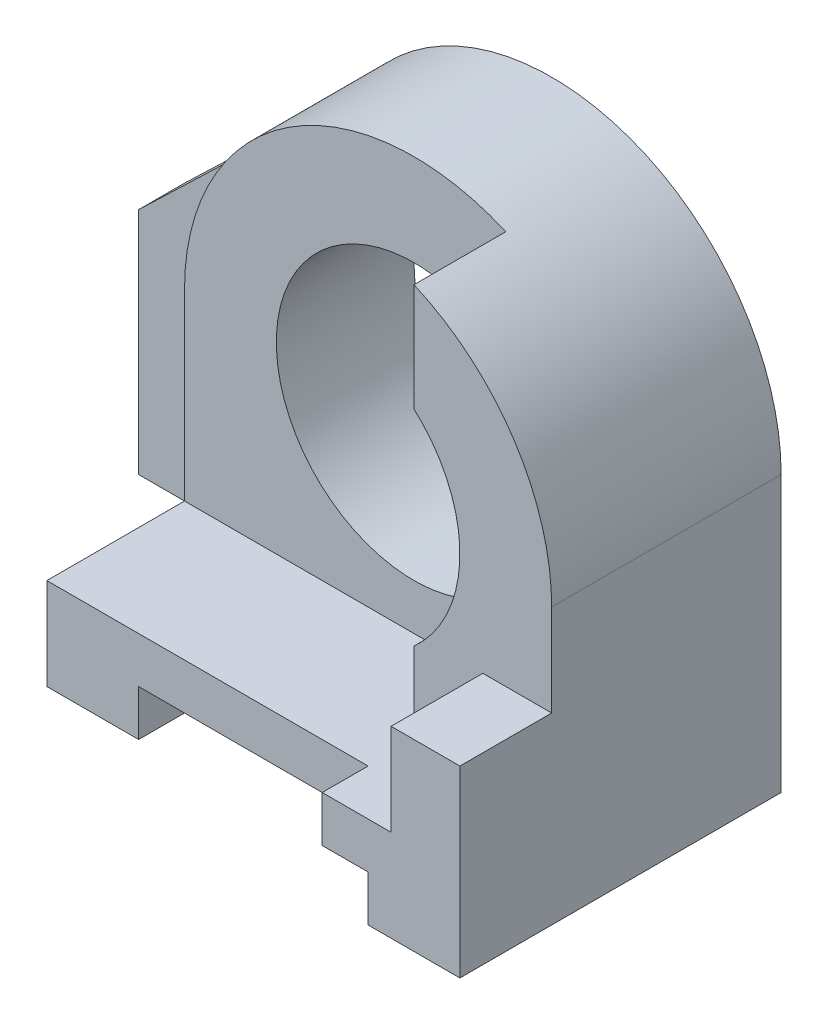
ISO-10303-21;
HEADER;
FILE_DESCRIPTION(('STEP AP214'),'2;1');
FILE_NAME('part.step','',(''),(''),'','','');
FILE_SCHEMA(('AUTOMOTIVE_DESIGN { 1 0 10303 214 1 1 1 1 }'));
ENDSEC;
DATA;
#1=APPLICATION_CONTEXT('core data for automotive mechanical design processes');
#2=APPLICATION_PROTOCOL_DEFINITION('international standard','automotive_design',2000,#1);
#3=PRODUCT_CONTEXT('',#1,'mechanical');
#4=PRODUCT('Part','Part','',(#3));
#5=PRODUCT_RELATED_PRODUCT_CATEGORY('part','',(#4));
#6=PRODUCT_DEFINITION_FORMATION('','',#4);
#7=PRODUCT_DEFINITION_CONTEXT('part definition',#1,'design');
#8=PRODUCT_DEFINITION('design','',#6,#7);
#9=PRODUCT_DEFINITION_SHAPE('','',#8);
#10=(LENGTH_UNIT() NAMED_UNIT(*) SI_UNIT(.MILLI.,.METRE.));
#11=(NAMED_UNIT(*) PLANE_ANGLE_UNIT() SI_UNIT($,.RADIAN.));
#12=(NAMED_UNIT(*) SI_UNIT($,.STERADIAN.) SOLID_ANGLE_UNIT());
#13=UNCERTAINTY_MEASURE_WITH_UNIT(LENGTH_MEASURE(1.E-05),#10,'distance_accuracy_value','');
#14=(GEOMETRIC_REPRESENTATION_CONTEXT(3) GLOBAL_UNCERTAINTY_ASSIGNED_CONTEXT((#13)) GLOBAL_UNIT_ASSIGNED_CONTEXT((#10,
#11,#12)) REPRESENTATION_CONTEXT('',''));
#15=CARTESIAN_POINT('',(0.,0.,0.));
#16=DIRECTION('',(0.,0.,1.));
#17=DIRECTION('',(1.,0.,0.));
#18=AXIS2_PLACEMENT_3D('',#15,#16,#17);
#19=CARTESIAN_POINT('',(0.,6.,7.));
#20=DIRECTION('',(1.,0.,0.));
#21=DIRECTION('',(0.,1.,0.));
#22=AXIS2_PLACEMENT_3D('',#19,#20,#21);
#23=PLANE('',#22);
#24=DIRECTION('',(0.,-1.,0.));
#25=VECTOR('',#24,1.);
#26=CARTESIAN_POINT('',(0.,14.,3.));
#27=LINE('',#26,#25);
#28=CARTESIAN_POINT('',(0.,6.,3.));
#29=VERTEX_POINT('',#28);
#30=CARTESIAN_POINT('',(0.,2.,3.));
#31=VERTEX_POINT('',#30);
#32=EDGE_CURVE('E186',#29,#31,#27,.T.);
#33=ORIENTED_EDGE('',*,*,#32,.F.);
#34=DIRECTION('',(0.,0.,-1.));
#35=VECTOR('',#34,1.);
#36=CARTESIAN_POINT('',(0.,6.,7.));
#37=LINE('',#36,#35);
#38=CARTESIAN_POINT('',(0.,6.,1.));
#39=VERTEX_POINT('',#38);
#40=EDGE_CURVE('E298',#29,#39,#37,.T.);
#41=ORIENTED_EDGE('',*,*,#40,.T.);
#42=DIRECTION('',(0.,-1.,0.));
#43=VECTOR('',#42,1.);
#44=CARTESIAN_POINT('',(0.,6.,1.));
#45=LINE('',#44,#43);
#46=CARTESIAN_POINT('',(0.,0.,1.));
#47=VERTEX_POINT('',#46);
#48=EDGE_CURVE('E278',#39,#47,#45,.T.);
#49=ORIENTED_EDGE('',*,*,#48,.T.);
#50=DIRECTION('',(0.,0.,-1.));
#51=VECTOR('',#50,1.);
#52=CARTESIAN_POINT('',(0.,0.,7.));
#53=LINE('',#52,#51);
#54=CARTESIAN_POINT('',(0.,0.,6.));
#55=VERTEX_POINT('',#54);
#56=EDGE_CURVE('E55',#55,#47,#53,.T.);
#57=ORIENTED_EDGE('',*,*,#56,.F.);
#58=DIRECTION('',(0.,-1.,0.));
#59=VECTOR('',#58,1.);
#60=CARTESIAN_POINT('',(0.,12.,6.));
#61=LINE('',#60,#59);
#62=CARTESIAN_POINT('',(0.,2.,6.));
#63=VERTEX_POINT('',#62);
#64=EDGE_CURVE('E213',#63,#55,#61,.T.);
#65=ORIENTED_EDGE('',*,*,#64,.F.);
#66=DIRECTION('',(0.,0.,1.));
#67=VECTOR('',#66,1.);
#68=CARTESIAN_POINT('',(0.,2.,3.));
#69=LINE('',#68,#67);
#70=EDGE_CURVE('E47',#31,#63,#69,.T.);
#71=ORIENTED_EDGE('',*,*,#70,.F.);
#72=EDGE_LOOP('',(#33,#41,#49,#57,#65,#71));
#73=FACE_BOUND('',#72,.T.);
#74=ADVANCED_FACE('F33',(#73),#23,.F.);
#75=CARTESIAN_POINT('',(5.,6.,7.));
#76=DIRECTION('',(0.,0.,-1.));
#77=DIRECTION('',(-1.,0.,0.));
#78=AXIS2_PLACEMENT_3D('',#75,#76,#77);
#79=CYLINDRICAL_SURFACE('',#78,5.);
#80=DIRECTION('',(0.,0.,-1.));
#81=VECTOR('',#80,1.);
#82=CARTESIAN_POINT('',(7.,10.5825756949558,7.));
#83=LINE('',#82,#81);
#84=CARTESIAN_POINT('',(7.,10.5825756949558,5.));
#85=VERTEX_POINT('',#84);
#86=CARTESIAN_POINT('',(7.,10.5825756949558,3.));
#87=VERTEX_POINT('',#86);
#88=EDGE_CURVE('E205',#85,#87,#83,.T.);
#89=ORIENTED_EDGE('',*,*,#88,.F.);
#90=CARTESIAN_POINT('',(5.,6.,5.));
#91=DIRECTION('',(0.,0.,1.));
#92=DIRECTION('',(1.,0.,0.));
#93=AXIS2_PLACEMENT_3D('',#90,#91,#92);
#94=CIRCLE('',#93,5.);
#95=CARTESIAN_POINT('',(10.,6.,5.));
#96=VERTEX_POINT('',#95);
#97=EDGE_CURVE('E251',#96,#85,#94,.T.);
#98=ORIENTED_EDGE('',*,*,#97,.F.);
#99=DIRECTION('',(0.,0.,-1.));
#100=VECTOR('',#99,1.);
#101=CARTESIAN_POINT('',(10.,6.,7.));
#102=LINE('',#101,#100);
#103=CARTESIAN_POINT('',(10.,6.,0.));
#104=VERTEX_POINT('',#103);
#105=EDGE_CURVE('E315',#96,#104,#102,.T.);
#106=ORIENTED_EDGE('',*,*,#105,.T.);
#107=CARTESIAN_POINT('',(5.,6.,0.));
#108=DIRECTION('',(0.,0.,1.));
#109=DIRECTION('',(1.,0.,0.));
#110=AXIS2_PLACEMENT_3D('',#107,#108,#109);
#111=CIRCLE('',#110,5.);
#112=CARTESIAN_POINT('',(0.705752772547543,8.56114051733146,0.));
#113=VERTEX_POINT('',#112);
#114=EDGE_CURVE('E291',#104,#113,#111,.T.);
#115=ORIENTED_EDGE('',*,*,#114,.T.);
#116=DIRECTION('',(0.,0.,-1.));
#117=VECTOR('',#116,1.);
#118=CARTESIAN_POINT('',(0.705752772547543,8.56114051733146,1.));
#119=LINE('',#118,#117);
#120=CARTESIAN_POINT('',(0.705752772547544,8.56114051733146,1.));
#121=VERTEX_POINT('',#120);
#122=EDGE_CURVE('E275',#121,#113,#119,.T.);
#123=ORIENTED_EDGE('',*,*,#122,.F.);
#124=CARTESIAN_POINT('',(5.,6.,1.));
#125=DIRECTION('',(0.,0.,1.));
#126=DIRECTION('',(1.,0.,0.));
#127=AXIS2_PLACEMENT_3D('',#124,#125,#126);
#128=CIRCLE('',#127,5.);
#129=EDGE_CURVE('E331',#121,#39,#128,.T.);
#130=ORIENTED_EDGE('',*,*,#129,.T.);
#131=ORIENTED_EDGE('',*,*,#40,.F.);
#132=CARTESIAN_POINT('',(5.,6.,3.));
#133=DIRECTION('',(0.,0.,1.));
#134=DIRECTION('',(1.,0.,0.));
#135=AXIS2_PLACEMENT_3D('',#132,#133,#134);
#136=CIRCLE('',#135,5.);
#137=EDGE_CURVE('E204',#87,#29,#136,.T.);
#138=ORIENTED_EDGE('',*,*,#137,.F.);
#139=EDGE_LOOP('',(#89,#98,#106,#115,#123,#130,#131,#138));
#140=FACE_BOUND('',#139,.T.);
#141=ADVANCED_FACE('F347',(#140),#79,.T.);
#142=CARTESIAN_POINT('',(5.,6.,7.));
#143=DIRECTION('',(0.,0.,-1.));
#144=DIRECTION('',(-1.,0.,0.));
#145=AXIS2_PLACEMENT_3D('',#142,#143,#144);
#146=CYLINDRICAL_SURFACE('',#145,3.);
#147=CARTESIAN_POINT('',(5.,6.,0.));
#148=DIRECTION('',(0.,0.,1.));
#149=DIRECTION('',(1.,0.,0.));
#150=AXIS2_PLACEMENT_3D('',#147,#148,#149);
#151=CIRCLE('',#150,3.);
#152=CARTESIAN_POINT('',(8.,6.,0.));
#153=VERTEX_POINT('',#152);
#154=EDGE_CURVE('E284',#153,#153,#151,.T.);
#155=ORIENTED_EDGE('',*,*,#154,.F.);
#156=EDGE_LOOP('',(#155));
#157=FACE_BOUND('',#156,.T.);
#158=CARTESIAN_POINT('',(5.,6.,5.));
#159=DIRECTION('',(0.,0.,1.));
#160=DIRECTION('',(1.,0.,0.));
#161=AXIS2_PLACEMENT_3D('',#158,#159,#160);
#162=CIRCLE('',#161,3.);
#163=CARTESIAN_POINT('',(7.,3.76393202250021,5.));
#164=VERTEX_POINT('',#163);
#165=CARTESIAN_POINT('',(7.,8.23606797749979,5.));
#166=VERTEX_POINT('',#165);
#167=EDGE_CURVE('E40',#164,#166,#162,.T.);
#168=ORIENTED_EDGE('',*,*,#167,.T.);
#169=DIRECTION('',(0.,0.,-1.));
#170=VECTOR('',#169,1.);
#171=CARTESIAN_POINT('',(7.,8.23606797749979,7.));
#172=LINE('',#171,#170);
#173=CARTESIAN_POINT('',(7.,8.23606797749979,3.));
#174=VERTEX_POINT('',#173);
#175=EDGE_CURVE('E206',#166,#174,#172,.T.);
#176=ORIENTED_EDGE('',*,*,#175,.T.);
#177=CARTESIAN_POINT('',(5.,6.,3.));
#178=DIRECTION('',(0.,0.,1.));
#179=DIRECTION('',(1.,0.,0.));
#180=AXIS2_PLACEMENT_3D('',#177,#178,#179);
#181=CIRCLE('',#180,3.);
#182=CARTESIAN_POINT('',(7.,3.76393202250021,3.));
#183=VERTEX_POINT('',#182);
#184=EDGE_CURVE('E11',#174,#183,#181,.T.);
#185=ORIENTED_EDGE('',*,*,#184,.T.);
#186=DIRECTION('',(0.,0.,-1.));
#187=VECTOR('',#186,1.);
#188=CARTESIAN_POINT('',(7.,3.76393202250021,7.));
#189=LINE('',#188,#187);
#190=EDGE_CURVE('E182',#183,#164,#189,.F.);
#191=ORIENTED_EDGE('',*,*,#190,.T.);
#192=EDGE_LOOP('',(#168,#176,#185,#191));
#193=FACE_BOUND('',#192,.T.);
#194=ADVANCED_FACE('F336',(#157,#193),#146,.F.);
#195=CARTESIAN_POINT('',(7.,12.,6.));
#196=DIRECTION('',(0.,0.,1.));
#197=DIRECTION('',(1.,0.,0.));
#198=AXIS2_PLACEMENT_3D('',#195,#196,#197);
#199=PLANE('',#198);
#200=DIRECTION('',(0.,-1.,0.));
#201=VECTOR('',#200,1.);
#202=CARTESIAN_POINT('',(7.,12.,6.));
#203=LINE('',#202,#201);
#204=CARTESIAN_POINT('',(7.,2.,6.));
#205=VERTEX_POINT('',#204);
#206=CARTESIAN_POINT('',(7.,1.,6.));
#207=VERTEX_POINT('',#206);
#208=EDGE_CURVE('E215',#205,#207,#203,.T.);
#209=ORIENTED_EDGE('',*,*,#208,.F.);
#210=DIRECTION('',(1.,0.,0.));
#211=VECTOR('',#210,1.);
#212=CARTESIAN_POINT('',(0.,2.,6.));
#213=LINE('',#212,#211);
#214=EDGE_CURVE('E198',#63,#205,#213,.T.);
#215=ORIENTED_EDGE('',*,*,#214,.F.);
#216=ORIENTED_EDGE('',*,*,#64,.T.);
#217=DIRECTION('',(-1.,0.,0.));
#218=VECTOR('',#217,1.);
#219=CARTESIAN_POINT('',(7.,0.,6.));
#220=LINE('',#219,#218);
#221=CARTESIAN_POINT('',(2.,0.,6.));
#222=VERTEX_POINT('',#221);
#223=EDGE_CURVE('E211',#222,#55,#220,.T.);
#224=ORIENTED_EDGE('',*,*,#223,.F.);
#225=DIRECTION('',(0.,1.,0.));
#226=VECTOR('',#225,1.);
#227=CARTESIAN_POINT('',(2.,0.,6.));
#228=LINE('',#227,#226);
#229=CARTESIAN_POINT('',(2.,1.,6.));
#230=VERTEX_POINT('',#229);
#231=EDGE_CURVE('E223',#222,#230,#228,.T.);
#232=ORIENTED_EDGE('',*,*,#231,.T.);
#233=DIRECTION('',(1.,0.,0.));
#234=VECTOR('',#233,1.);
#235=CARTESIAN_POINT('',(2.,1.,6.));
#236=LINE('',#235,#234);
#237=EDGE_CURVE('E221',#230,#207,#236,.T.);
#238=ORIENTED_EDGE('',*,*,#237,.T.);
#239=EDGE_LOOP('',(#209,#215,#216,#224,#232,#238));
#240=FACE_BOUND('',#239,.T.);
#241=ADVANCED_FACE('F354',(#240),#199,.T.);
#242=CARTESIAN_POINT('',(5.,6.,7.));
#243=DIRECTION('',(0.,0.,1.));
#244=DIRECTION('',(1.,0.,0.));
#245=AXIS2_PLACEMENT_3D('',#242,#243,#244);
#246=PLANE('',#245);
#247=DIRECTION('',(1.,0.,0.));
#248=VECTOR('',#247,1.);
#249=CARTESIAN_POINT('',(7.,2.,7.));
#250=LINE('',#249,#248);
#251=CARTESIAN_POINT('',(7.,2.,7.));
#252=VERTEX_POINT('',#251);
#253=CARTESIAN_POINT('',(8.5,2.,7.));
#254=VERTEX_POINT('',#253);
#255=EDGE_CURVE('E227',#252,#254,#250,.T.);
#256=ORIENTED_EDGE('',*,*,#255,.F.);
#257=DIRECTION('',(0.,-1.,0.));
#258=VECTOR('',#257,1.);
#259=CARTESIAN_POINT('',(7.,12.,7.));
#260=LINE('',#259,#258);
#261=CARTESIAN_POINT('',(7.,1.,7.));
#262=VERTEX_POINT('',#261);
#263=EDGE_CURVE('E218',#252,#262,#260,.T.);
#264=ORIENTED_EDGE('',*,*,#263,.T.);
#265=DIRECTION('',(1.,0.,0.));
#266=VECTOR('',#265,1.);
#267=CARTESIAN_POINT('',(2.,1.,7.));
#268=LINE('',#267,#266);
#269=CARTESIAN_POINT('',(8.,1.,7.));
#270=VERTEX_POINT('',#269);
#271=EDGE_CURVE('E288',#262,#270,#268,.T.);
#272=ORIENTED_EDGE('',*,*,#271,.T.);
#273=DIRECTION('',(0.,-1.,0.));
#274=VECTOR('',#273,1.);
#275=CARTESIAN_POINT('',(8.,1.,7.));
#276=LINE('',#275,#274);
#277=CARTESIAN_POINT('',(8.,0.,7.));
#278=VERTEX_POINT('',#277);
#279=EDGE_CURVE('E290',#270,#278,#276,.T.);
#280=ORIENTED_EDGE('',*,*,#279,.T.);
#281=DIRECTION('',(1.,0.,0.));
#282=VECTOR('',#281,1.);
#283=CARTESIAN_POINT('',(8.,0.,7.));
#284=LINE('',#283,#282);
#285=CARTESIAN_POINT('',(10.,0.,7.));
#286=VERTEX_POINT('',#285);
#287=EDGE_CURVE('E293',#278,#286,#284,.T.);
#288=ORIENTED_EDGE('',*,*,#287,.T.);
#289=DIRECTION('',(0.,1.,0.));
#290=VECTOR('',#289,1.);
#291=CARTESIAN_POINT('',(10.,0.,7.));
#292=LINE('',#291,#290);
#293=CARTESIAN_POINT('',(10.,4.,7.));
#294=VERTEX_POINT('',#293);
#295=EDGE_CURVE('E295',#286,#294,#292,.T.);
#296=ORIENTED_EDGE('',*,*,#295,.T.);
#297=DIRECTION('',(1.,0.,0.));
#298=VECTOR('',#297,1.);
#299=CARTESIAN_POINT('',(8.5,4.,7.));
#300=LINE('',#299,#298);
#301=CARTESIAN_POINT('',(8.5,4.,7.));
#302=VERTEX_POINT('',#301);
#303=EDGE_CURVE('E246',#302,#294,#300,.T.);
#304=ORIENTED_EDGE('',*,*,#303,.F.);
#305=DIRECTION('',(0.,1.,0.));
#306=VECTOR('',#305,1.);
#307=CARTESIAN_POINT('',(8.5,2.,7.));
#308=LINE('',#307,#306);
#309=EDGE_CURVE('E243',#254,#302,#308,.T.);
#310=ORIENTED_EDGE('',*,*,#309,.F.);
#311=EDGE_LOOP('',(#256,#264,#272,#280,#288,#296,#304,#310));
#312=FACE_BOUND('',#311,.T.);
#313=ADVANCED_FACE('F374',(#312),#246,.T.);
#314=CARTESIAN_POINT('',(0.,0.,7.));
#315=DIRECTION('',(0.,1.,0.));
#316=DIRECTION('',(0.,0.,1.));
#317=AXIS2_PLACEMENT_3D('',#314,#315,#316);
#318=PLANE('',#317);
#319=ORIENTED_EDGE('',*,*,#223,.T.);
#320=ORIENTED_EDGE('',*,*,#56,.T.);
#321=DIRECTION('',(-1.,0.,0.));
#322=VECTOR('',#321,1.);
#323=CARTESIAN_POINT('',(0.,0.,1.));
#324=LINE('',#323,#322);
#325=CARTESIAN_POINT('',(-3.,0.,1.));
#326=VERTEX_POINT('',#325);
#327=EDGE_CURVE('E261',#47,#326,#324,.T.);
#328=ORIENTED_EDGE('',*,*,#327,.T.);
#329=DIRECTION('',(0.,0.,-1.));
#330=VECTOR('',#329,1.);
#331=CARTESIAN_POINT('',(-3.,0.,1.));
#332=LINE('',#331,#330);
#333=CARTESIAN_POINT('',(-3.,0.,0.));
#334=VERTEX_POINT('',#333);
#335=EDGE_CURVE('E270',#326,#334,#332,.T.);
#336=ORIENTED_EDGE('',*,*,#335,.T.);
#337=DIRECTION('',(1.,0.,0.));
#338=VECTOR('',#337,1.);
#339=CARTESIAN_POINT('',(0.,0.,0.));
#340=LINE('',#339,#338);
#341=CARTESIAN_POINT('',(2.,0.,0.));
#342=VERTEX_POINT('',#341);
#343=EDGE_CURVE('E287',#334,#342,#340,.T.);
#344=ORIENTED_EDGE('',*,*,#343,.T.);
#345=DIRECTION('',(0.,0.,-1.));
#346=VECTOR('',#345,1.);
#347=CARTESIAN_POINT('',(2.,0.,7.));
#348=LINE('',#347,#346);
#349=EDGE_CURVE('E328',#222,#342,#348,.T.);
#350=ORIENTED_EDGE('',*,*,#349,.F.);
#351=EDGE_LOOP('',(#319,#320,#328,#336,#344,#350));
#352=FACE_BOUND('',#351,.T.);
#353=ADVANCED_FACE('F357',(#352),#318,.F.);
#354=CARTESIAN_POINT('',(2.,0.,7.));
#355=DIRECTION('',(-1.,0.,0.));
#356=DIRECTION('',(0.,0.,1.));
#357=AXIS2_PLACEMENT_3D('',#354,#355,#356);
#358=PLANE('',#357);
#359=ORIENTED_EDGE('',*,*,#231,.F.);
#360=ORIENTED_EDGE('',*,*,#349,.T.);
#361=DIRECTION('',(0.,1.,0.));
#362=VECTOR('',#361,1.);
#363=CARTESIAN_POINT('',(2.,0.,0.));
#364=LINE('',#363,#362);
#365=CARTESIAN_POINT('',(2.,1.,0.));
#366=VERTEX_POINT('',#365);
#367=EDGE_CURVE('E301',#342,#366,#364,.T.);
#368=ORIENTED_EDGE('',*,*,#367,.T.);
#369=DIRECTION('',(0.,0.,-1.));
#370=VECTOR('',#369,1.);
#371=CARTESIAN_POINT('',(2.,1.,7.));
#372=LINE('',#371,#370);
#373=EDGE_CURVE('E326',#230,#366,#372,.T.);
#374=ORIENTED_EDGE('',*,*,#373,.F.);
#375=EDGE_LOOP('',(#359,#360,#368,#374));
#376=FACE_BOUND('',#375,.T.);
#377=ADVANCED_FACE('F360',(#376),#358,.F.);
#378=CARTESIAN_POINT('',(2.,1.,7.));
#379=DIRECTION('',(0.,1.,0.));
#380=DIRECTION('',(0.,0.,1.));
#381=AXIS2_PLACEMENT_3D('',#378,#379,#380);
#382=PLANE('',#381);
#383=DIRECTION('',(0.,0.,1.));
#384=VECTOR('',#383,1.);
#385=CARTESIAN_POINT('',(7.,1.,7.));
#386=LINE('',#385,#384);
#387=EDGE_CURVE('E225',#207,#262,#386,.T.);
#388=ORIENTED_EDGE('',*,*,#387,.F.);
#389=ORIENTED_EDGE('',*,*,#237,.F.);
#390=ORIENTED_EDGE('',*,*,#373,.T.);
#391=DIRECTION('',(1.,0.,0.));
#392=VECTOR('',#391,1.);
#393=CARTESIAN_POINT('',(2.,1.,0.));
#394=LINE('',#393,#392);
#395=CARTESIAN_POINT('',(8.,1.,0.));
#396=VERTEX_POINT('',#395);
#397=EDGE_CURVE('E304',#366,#396,#394,.T.);
#398=ORIENTED_EDGE('',*,*,#397,.T.);
#399=DIRECTION('',(0.,0.,-1.));
#400=VECTOR('',#399,1.);
#401=CARTESIAN_POINT('',(8.,1.,7.));
#402=LINE('',#401,#400);
#403=EDGE_CURVE('E323',#270,#396,#402,.T.);
#404=ORIENTED_EDGE('',*,*,#403,.F.);
#405=ORIENTED_EDGE('',*,*,#271,.F.);
#406=EDGE_LOOP('',(#388,#389,#390,#398,#404,#405));
#407=FACE_BOUND('',#406,.T.);
#408=ADVANCED_FACE('F366',(#407),#382,.F.);
#409=CARTESIAN_POINT('',(5.,6.,0.));
#410=DIRECTION('',(0.,0.,1.));
#411=DIRECTION('',(1.,0.,0.));
#412=AXIS2_PLACEMENT_3D('',#409,#410,#411);
#413=PLANE('',#412);
#414=ORIENTED_EDGE('',*,*,#367,.F.);
#415=ORIENTED_EDGE('',*,*,#343,.F.);
#416=DIRECTION('',(0.,1.,0.));
#417=VECTOR('',#416,1.);
#418=CARTESIAN_POINT('',(-3.,0.,0.));
#419=LINE('',#418,#417);
#420=CARTESIAN_POINT('',(-3.,5.,0.));
#421=VERTEX_POINT('',#420);
#422=EDGE_CURVE('E260',#334,#421,#419,.T.);
#423=ORIENTED_EDGE('',*,*,#422,.T.);
#424=DIRECTION('',(0.721035554457043,0.692898065525387,0.));
#425=VECTOR('',#424,1.);
#426=CARTESIAN_POINT('',(-3.,5.,0.));
#427=LINE('',#426,#425);
#428=EDGE_CURVE('E264',#421,#113,#427,.T.);
#429=ORIENTED_EDGE('',*,*,#428,.T.);
#430=ORIENTED_EDGE('',*,*,#114,.F.);
#431=DIRECTION('',(0.,1.,0.));
#432=VECTOR('',#431,1.);
#433=CARTESIAN_POINT('',(10.,0.,0.));
#434=LINE('',#433,#432);
#435=CARTESIAN_POINT('',(10.,0.,0.));
#436=VERTEX_POINT('',#435);
#437=EDGE_CURVE('E310',#436,#104,#434,.T.);
#438=ORIENTED_EDGE('',*,*,#437,.F.);
#439=DIRECTION('',(1.,0.,0.));
#440=VECTOR('',#439,1.);
#441=CARTESIAN_POINT('',(8.,0.,0.));
#442=LINE('',#441,#440);
#443=CARTESIAN_POINT('',(8.,0.,0.));
#444=VERTEX_POINT('',#443);
#445=EDGE_CURVE('E308',#444,#436,#442,.T.);
#446=ORIENTED_EDGE('',*,*,#445,.F.);
#447=DIRECTION('',(0.,-1.,0.));
#448=VECTOR('',#447,1.);
#449=CARTESIAN_POINT('',(8.,1.,0.));
#450=LINE('',#449,#448);
#451=EDGE_CURVE('E306',#396,#444,#450,.T.);
#452=ORIENTED_EDGE('',*,*,#451,.F.);
#453=ORIENTED_EDGE('',*,*,#397,.F.);
#454=EDGE_LOOP('',(#414,#415,#423,#429,#430,#438,#446,#452,#453));
#455=FACE_BOUND('',#454,.T.);
#456=ORIENTED_EDGE('',*,*,#154,.T.);
#457=EDGE_LOOP('',(#456));
#458=FACE_BOUND('',#457,.T.);
#459=ADVANCED_FACE('F394',(#455,#458),#413,.F.);
#460=CARTESIAN_POINT('',(8.,1.,7.));
#461=DIRECTION('',(1.,0.,0.));
#462=DIRECTION('',(0.,0.,-1.));
#463=AXIS2_PLACEMENT_3D('',#460,#461,#462);
#464=PLANE('',#463);
#465=ORIENTED_EDGE('',*,*,#451,.T.);
#466=DIRECTION('',(0.,0.,-1.));
#467=VECTOR('',#466,1.);
#468=CARTESIAN_POINT('',(8.,0.,7.));
#469=LINE('',#468,#467);
#470=EDGE_CURVE('E320',#278,#444,#469,.T.);
#471=ORIENTED_EDGE('',*,*,#470,.F.);
#472=ORIENTED_EDGE('',*,*,#279,.F.);
#473=ORIENTED_EDGE('',*,*,#403,.T.);
#474=EDGE_LOOP('',(#465,#471,#472,#473));
#475=FACE_BOUND('',#474,.T.);
#476=ADVANCED_FACE('F434',(#475),#464,.F.);
#477=CARTESIAN_POINT('',(8.,0.,7.));
#478=DIRECTION('',(0.,1.,0.));
#479=DIRECTION('',(0.,0.,1.));
#480=AXIS2_PLACEMENT_3D('',#477,#478,#479);
#481=PLANE('',#480);
#482=ORIENTED_EDGE('',*,*,#445,.T.);
#483=DIRECTION('',(0.,0.,-1.));
#484=VECTOR('',#483,1.);
#485=CARTESIAN_POINT('',(10.,0.,7.));
#486=LINE('',#485,#484);
#487=EDGE_CURVE('E317',#286,#436,#486,.T.);
#488=ORIENTED_EDGE('',*,*,#487,.F.);
#489=ORIENTED_EDGE('',*,*,#287,.F.);
#490=ORIENTED_EDGE('',*,*,#470,.T.);
#491=EDGE_LOOP('',(#482,#488,#489,#490));
#492=FACE_BOUND('',#491,.T.);
#493=ADVANCED_FACE('F431',(#492),#481,.F.);
#494=CARTESIAN_POINT('',(10.,0.,7.));
#495=DIRECTION('',(-1.,0.,0.));
#496=DIRECTION('',(0.,0.,1.));
#497=AXIS2_PLACEMENT_3D('',#494,#495,#496);
#498=PLANE('',#497);
#499=DIRECTION('',(0.,1.,0.));
#500=VECTOR('',#499,1.);
#501=CARTESIAN_POINT('',(10.,4.,5.));
#502=LINE('',#501,#500);
#503=CARTESIAN_POINT('',(10.,4.,5.));
#504=VERTEX_POINT('',#503);
#505=EDGE_CURVE('E239',#504,#96,#502,.T.);
#506=ORIENTED_EDGE('',*,*,#505,.F.);
#507=DIRECTION('',(0.,0.,1.));
#508=VECTOR('',#507,1.);
#509=CARTESIAN_POINT('',(10.,4.,5.));
#510=LINE('',#509,#508);
#511=EDGE_CURVE('E248',#504,#294,#510,.T.);
#512=ORIENTED_EDGE('',*,*,#511,.T.);
#513=ORIENTED_EDGE('',*,*,#295,.F.);
#514=ORIENTED_EDGE('',*,*,#487,.T.);
#515=ORIENTED_EDGE('',*,*,#437,.T.);
#516=ORIENTED_EDGE('',*,*,#105,.F.);
#517=EDGE_LOOP('',(#506,#512,#513,#514,#515,#516));
#518=FACE_BOUND('',#517,.T.);
#519=ADVANCED_FACE('F384',(#518),#498,.F.);
#520=CARTESIAN_POINT('',(-3.,5.,1.));
#521=DIRECTION('',(-0.692898065525388,0.721035554457043,0.));
#522=DIRECTION('',(-0.721035554457043,-0.692898065525388,0.));
#523=AXIS2_PLACEMENT_3D('',#520,#521,#522);
#524=PLANE('',#523);
#525=ORIENTED_EDGE('',*,*,#428,.F.);
#526=DIRECTION('',(0.,0.,-1.));
#527=VECTOR('',#526,1.);
#528=CARTESIAN_POINT('',(-3.,5.,1.));
#529=LINE('',#528,#527);
#530=CARTESIAN_POINT('',(-3.,5.,1.));
#531=VERTEX_POINT('',#530);
#532=EDGE_CURVE('E279',#531,#421,#529,.T.);
#533=ORIENTED_EDGE('',*,*,#532,.F.);
#534=DIRECTION('',(0.721035554457043,0.692898065525387,0.));
#535=VECTOR('',#534,1.);
#536=CARTESIAN_POINT('',(-3.,5.,1.));
#537=LINE('',#536,#535);
#538=EDGE_CURVE('E267',#531,#121,#537,.T.);
#539=ORIENTED_EDGE('',*,*,#538,.T.);
#540=ORIENTED_EDGE('',*,*,#122,.T.);
#541=EDGE_LOOP('',(#525,#533,#539,#540));
#542=FACE_BOUND('',#541,.T.);
#543=ADVANCED_FACE('F392',(#542),#524,.T.);
#544=CARTESIAN_POINT('',(-3.,0.,1.));
#545=DIRECTION('',(-1.,0.,0.));
#546=DIRECTION('',(0.,0.,1.));
#547=AXIS2_PLACEMENT_3D('',#544,#545,#546);
#548=PLANE('',#547);
#549=ORIENTED_EDGE('',*,*,#422,.F.);
#550=ORIENTED_EDGE('',*,*,#335,.F.);
#551=DIRECTION('',(0.,1.,0.));
#552=VECTOR('',#551,1.);
#553=CARTESIAN_POINT('',(-3.,0.,1.));
#554=LINE('',#553,#552);
#555=EDGE_CURVE('E263',#326,#531,#554,.T.);
#556=ORIENTED_EDGE('',*,*,#555,.T.);
#557=ORIENTED_EDGE('',*,*,#532,.T.);
#558=EDGE_LOOP('',(#549,#550,#556,#557));
#559=FACE_BOUND('',#558,.T.);
#560=ADVANCED_FACE('F399',(#559),#548,.T.);
#561=CARTESIAN_POINT('',(0.,0.,1.));
#562=DIRECTION('',(0.,0.,1.));
#563=DIRECTION('',(1.,0.,0.));
#564=AXIS2_PLACEMENT_3D('',#561,#562,#563);
#565=PLANE('',#564);
#566=ORIENTED_EDGE('',*,*,#48,.F.);
#567=ORIENTED_EDGE('',*,*,#129,.F.);
#568=ORIENTED_EDGE('',*,*,#538,.F.);
#569=ORIENTED_EDGE('',*,*,#555,.F.);
#570=ORIENTED_EDGE('',*,*,#327,.F.);
#571=EDGE_LOOP('',(#566,#567,#568,#569,#570));
#572=FACE_BOUND('',#571,.T.);
#573=ADVANCED_FACE('F403',(#572),#565,.T.);
#574=CARTESIAN_POINT('',(0.,0.,5.));
#575=DIRECTION('',(0.,0.,1.));
#576=DIRECTION('',(1.,0.,0.));
#577=AXIS2_PLACEMENT_3D('',#574,#575,#576);
#578=PLANE('',#577);
#579=ORIENTED_EDGE('',*,*,#97,.T.);
#580=DIRECTION('',(0.,-1.,0.));
#581=VECTOR('',#580,1.);
#582=CARTESIAN_POINT('',(7.,10.5825756949558,5.));
#583=LINE('',#582,#581);
#584=EDGE_CURVE('E228',#85,#166,#583,.T.);
#585=ORIENTED_EDGE('',*,*,#584,.T.);
#586=ORIENTED_EDGE('',*,*,#167,.F.);
#587=CARTESIAN_POINT('',(7.,2.,5.));
#588=VERTEX_POINT('',#587);
#589=EDGE_CURVE('E231',#164,#588,#583,.T.);
#590=ORIENTED_EDGE('',*,*,#589,.T.);
#591=DIRECTION('',(1.,0.,0.));
#592=VECTOR('',#591,1.);
#593=CARTESIAN_POINT('',(7.,2.,5.));
#594=LINE('',#593,#592);
#595=CARTESIAN_POINT('',(8.5,2.,5.));
#596=VERTEX_POINT('',#595);
#597=EDGE_CURVE('E193',#588,#596,#594,.T.);
#598=ORIENTED_EDGE('',*,*,#597,.T.);
#599=DIRECTION('',(0.,1.,0.));
#600=VECTOR('',#599,1.);
#601=CARTESIAN_POINT('',(8.5,2.,5.));
#602=LINE('',#601,#600);
#603=CARTESIAN_POINT('',(8.5,4.,5.));
#604=VERTEX_POINT('',#603);
#605=EDGE_CURVE('E233',#596,#604,#602,.T.);
#606=ORIENTED_EDGE('',*,*,#605,.T.);
#607=DIRECTION('',(1.,0.,0.));
#608=VECTOR('',#607,1.);
#609=CARTESIAN_POINT('',(8.5,4.,5.));
#610=LINE('',#609,#608);
#611=EDGE_CURVE('E236',#604,#504,#610,.T.);
#612=ORIENTED_EDGE('',*,*,#611,.T.);
#613=ORIENTED_EDGE('',*,*,#505,.T.);
#614=EDGE_LOOP('',(#579,#585,#586,#590,#598,#606,#612,#613));
#615=FACE_BOUND('',#614,.T.);
#616=ADVANCED_FACE('F338',(#615),#578,.T.);
#617=CARTESIAN_POINT('',(8.5,4.,5.));
#618=DIRECTION('',(0.,-1.,0.));
#619=DIRECTION('',(0.,0.,-1.));
#620=AXIS2_PLACEMENT_3D('',#617,#618,#619);
#621=PLANE('',#620);
#622=ORIENTED_EDGE('',*,*,#303,.T.);
#623=ORIENTED_EDGE('',*,*,#511,.F.);
#624=ORIENTED_EDGE('',*,*,#611,.F.);
#625=DIRECTION('',(0.,0.,1.));
#626=VECTOR('',#625,1.);
#627=CARTESIAN_POINT('',(8.5,4.,5.));
#628=LINE('',#627,#626);
#629=EDGE_CURVE('E252',#604,#302,#628,.T.);
#630=ORIENTED_EDGE('',*,*,#629,.T.);
#631=EDGE_LOOP('',(#622,#623,#624,#630));
#632=FACE_BOUND('',#631,.T.);
#633=ADVANCED_FACE('F411',(#632),#621,.F.);
#634=CARTESIAN_POINT('',(8.5,2.,5.));
#635=DIRECTION('',(1.,0.,0.));
#636=DIRECTION('',(0.,0.,-1.));
#637=AXIS2_PLACEMENT_3D('',#634,#635,#636);
#638=PLANE('',#637);
#639=ORIENTED_EDGE('',*,*,#309,.T.);
#640=ORIENTED_EDGE('',*,*,#629,.F.);
#641=ORIENTED_EDGE('',*,*,#605,.F.);
#642=DIRECTION('',(0.,0.,1.));
#643=VECTOR('',#642,1.);
#644=CARTESIAN_POINT('',(8.5,2.,5.));
#645=LINE('',#644,#643);
#646=EDGE_CURVE('E254',#596,#254,#645,.T.);
#647=ORIENTED_EDGE('',*,*,#646,.T.);
#648=EDGE_LOOP('',(#639,#640,#641,#647));
#649=FACE_BOUND('',#648,.T.);
#650=ADVANCED_FACE('F379',(#649),#638,.F.);
#651=CARTESIAN_POINT('',(7.,2.,5.));
#652=DIRECTION('',(0.,-1.,0.));
#653=DIRECTION('',(1.,0.,0.));
#654=AXIS2_PLACEMENT_3D('',#651,#652,#653);
#655=PLANE('',#654);
#656=ORIENTED_EDGE('',*,*,#255,.T.);
#657=ORIENTED_EDGE('',*,*,#646,.F.);
#658=ORIENTED_EDGE('',*,*,#597,.F.);
#659=DIRECTION('',(0.,0.,-1.));
#660=VECTOR('',#659,1.);
#661=CARTESIAN_POINT('',(7.,2.,5.));
#662=LINE('',#661,#660);
#663=CARTESIAN_POINT('',(7.,2.,3.));
#664=VERTEX_POINT('',#663);
#665=EDGE_CURVE('E179',#588,#664,#662,.T.);
#666=ORIENTED_EDGE('',*,*,#665,.T.);
#667=DIRECTION('',(-1.,0.,0.));
#668=VECTOR('',#667,1.);
#669=CARTESIAN_POINT('',(7.,2.,3.));
#670=LINE('',#669,#668);
#671=EDGE_CURVE('E191',#664,#31,#670,.T.);
#672=ORIENTED_EDGE('',*,*,#671,.T.);
#673=ORIENTED_EDGE('',*,*,#70,.T.);
#674=ORIENTED_EDGE('',*,*,#214,.T.);
#675=DIRECTION('',(0.,0.,1.));
#676=VECTOR('',#675,1.);
#677=CARTESIAN_POINT('',(7.,2.,5.));
#678=LINE('',#677,#676);
#679=EDGE_CURVE('E241',#205,#252,#678,.T.);
#680=ORIENTED_EDGE('',*,*,#679,.T.);
#681=EDGE_LOOP('',(#656,#657,#658,#666,#672,#673,#674,#680));
#682=FACE_BOUND('',#681,.T.);
#683=ADVANCED_FACE('F190',(#682),#655,.F.);
#684=CARTESIAN_POINT('',(7.,12.,7.));
#685=DIRECTION('',(-1.,0.,0.));
#686=DIRECTION('',(0.,0.,1.));
#687=AXIS2_PLACEMENT_3D('',#684,#685,#686);
#688=PLANE('',#687);
#689=ORIENTED_EDGE('',*,*,#387,.T.);
#690=ORIENTED_EDGE('',*,*,#263,.F.);
#691=ORIENTED_EDGE('',*,*,#679,.F.);
#692=ORIENTED_EDGE('',*,*,#208,.T.);
#693=EDGE_LOOP('',(#689,#690,#691,#692));
#694=FACE_BOUND('',#693,.T.);
#695=ADVANCED_FACE('F370',(#694),#688,.T.);
#696=CARTESIAN_POINT('',(7.,14.,3.));
#697=DIRECTION('',(0.,0.,1.));
#698=DIRECTION('',(1.,0.,0.));
#699=AXIS2_PLACEMENT_3D('',#696,#697,#698);
#700=PLANE('',#699);
#701=ORIENTED_EDGE('',*,*,#137,.T.);
#702=ORIENTED_EDGE('',*,*,#32,.T.);
#703=ORIENTED_EDGE('',*,*,#671,.F.);
#704=DIRECTION('',(0.,-1.,0.));
#705=VECTOR('',#704,1.);
#706=CARTESIAN_POINT('',(7.,14.,3.));
#707=LINE('',#706,#705);
#708=EDGE_CURVE('E176',#183,#664,#707,.T.);
#709=ORIENTED_EDGE('',*,*,#708,.F.);
#710=ORIENTED_EDGE('',*,*,#184,.F.);
#711=EDGE_CURVE('E185',#87,#174,#707,.T.);
#712=ORIENTED_EDGE('',*,*,#711,.F.);
#713=EDGE_LOOP('',(#701,#702,#703,#709,#710,#712));
#714=FACE_BOUND('',#713,.T.);
#715=ADVANCED_FACE('F195',(#714),#700,.T.);
#716=CARTESIAN_POINT('',(7.,14.,5.));
#717=DIRECTION('',(-1.,0.,0.));
#718=DIRECTION('',(0.,0.,1.));
#719=AXIS2_PLACEMENT_3D('',#716,#717,#718);
#720=PLANE('',#719);
#721=ORIENTED_EDGE('',*,*,#88,.T.);
#722=ORIENTED_EDGE('',*,*,#711,.T.);
#723=ORIENTED_EDGE('',*,*,#175,.F.);
#724=ORIENTED_EDGE('',*,*,#584,.F.);
#725=EDGE_LOOP('',(#721,#722,#723,#724));
#726=FACE_BOUND('',#725,.T.);
#727=ADVANCED_FACE('F342',(#726),#720,.T.);
#728=ORIENTED_EDGE('',*,*,#708,.T.);
#729=ORIENTED_EDGE('',*,*,#665,.F.);
#730=ORIENTED_EDGE('',*,*,#589,.F.);
#731=ORIENTED_EDGE('',*,*,#190,.F.);
#732=EDGE_LOOP('',(#728,#729,#730,#731));
#733=FACE_BOUND('',#732,.T.);
#734=ADVANCED_FACE('F178',(#733),#720,.T.);
#735=CLOSED_SHELL('',(#74,#141,#194,#241,#313,#353,#377,#408,#459,#476,#493,#519,#543,#560,#573,
#616,#633,#650,#683,#695,#715,#727,#734));
#736=MANIFOLD_SOLID_BREP('B2',#735);
#737=ADVANCED_BREP_SHAPE_REPRESENTATION('',(#18,#736),#14);
#738=SHAPE_DEFINITION_REPRESENTATION(#9,#737);
ENDSEC;
END-ISO-10303-21;
